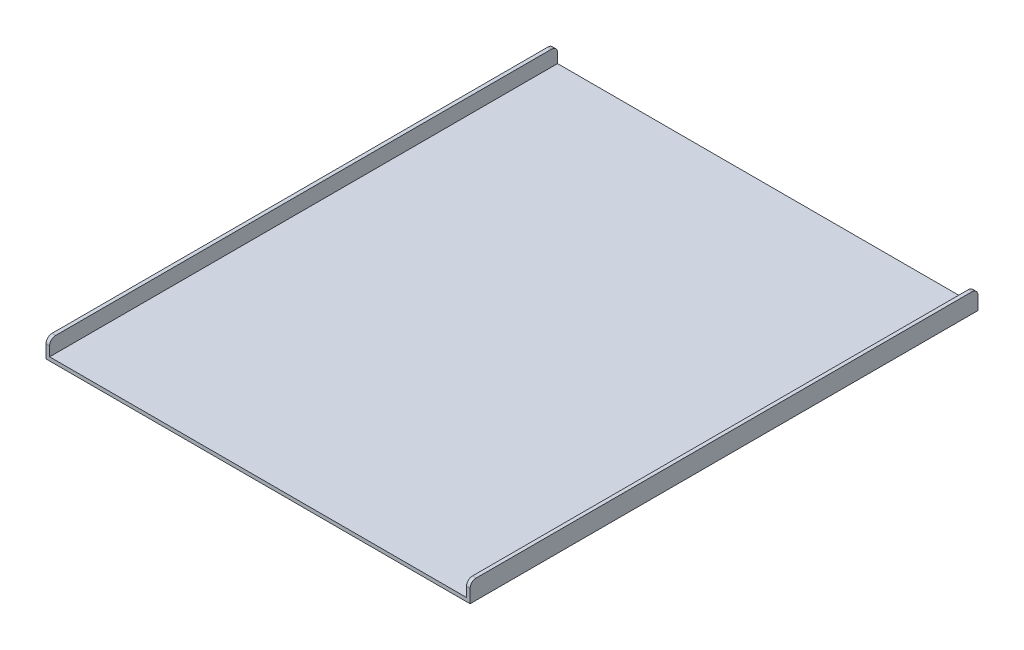
ISO-10303-21;
HEADER;
FILE_DESCRIPTION(('STEP AP214'),'2;1');
FILE_NAME('part.step','',(''),(''),'','','');
FILE_SCHEMA(('AUTOMOTIVE_DESIGN { 1 0 10303 214 1 1 1 1 }'));
ENDSEC;
DATA;
#1=APPLICATION_CONTEXT('core data for automotive mechanical design processes');
#2=APPLICATION_PROTOCOL_DEFINITION('international standard','automotive_design',2000,#1);
#3=PRODUCT_CONTEXT('',#1,'mechanical');
#4=PRODUCT('Part','Part','',(#3));
#5=PRODUCT_RELATED_PRODUCT_CATEGORY('part','',(#4));
#6=PRODUCT_DEFINITION_FORMATION('','',#4);
#7=PRODUCT_DEFINITION_CONTEXT('part definition',#1,'design');
#8=PRODUCT_DEFINITION('design','',#6,#7);
#9=PRODUCT_DEFINITION_SHAPE('','',#8);
#10=(LENGTH_UNIT() NAMED_UNIT(*) SI_UNIT(.MILLI.,.METRE.));
#11=(NAMED_UNIT(*) PLANE_ANGLE_UNIT() SI_UNIT($,.RADIAN.));
#12=(NAMED_UNIT(*) SI_UNIT($,.STERADIAN.) SOLID_ANGLE_UNIT());
#13=UNCERTAINTY_MEASURE_WITH_UNIT(LENGTH_MEASURE(1.E-05),#10,'distance_accuracy_value','');
#14=(GEOMETRIC_REPRESENTATION_CONTEXT(3) GLOBAL_UNCERTAINTY_ASSIGNED_CONTEXT((#13)) GLOBAL_UNIT_ASSIGNED_CONTEXT((#10,
#11,#12)) REPRESENTATION_CONTEXT('',''));
#15=CARTESIAN_POINT('',(0.,0.,0.));
#16=DIRECTION('',(0.,0.,1.));
#17=DIRECTION('',(1.,0.,0.));
#18=AXIS2_PLACEMENT_3D('',#15,#16,#17);
#19=CARTESIAN_POINT('',(446.551474958623,0.,421.049210887177));
#20=DIRECTION('',(-1.,0.,0.));
#21=DIRECTION('',(0.,0.,1.));
#22=AXIS2_PLACEMENT_3D('',#19,#20,#21);
#23=PLANE('',#22);
#24=DIRECTION('',(0.,1.,0.));
#25=VECTOR('',#24,1.);
#26=CARTESIAN_POINT('',(446.551474958623,0.,-421.049210887177));
#27=LINE('',#26,#25);
#28=CARTESIAN_POINT('',(446.551474958623,-6.04818389811423,-421.049210887177));
#29=VERTEX_POINT('',#28);
#30=CARTESIAN_POINT('',(446.551474958623,15.9156712813162,-421.049210887177));
#31=VERTEX_POINT('',#30);
#32=EDGE_CURVE('E157',#29,#31,#27,.T.);
#33=ORIENTED_EDGE('',*,*,#32,.T.);
#34=CARTESIAN_POINT('',(446.551474958623,15.9156712813162,-411.049210887177));
#35=DIRECTION('',(-1.,0.,0.));
#36=DIRECTION('',(0.,0.,1.));
#37=AXIS2_PLACEMENT_3D('',#34,#35,#36);
#38=CIRCLE('',#37,10.);
#39=CARTESIAN_POINT('',(446.551474958623,25.9156712813162,-411.049210887177));
#40=VERTEX_POINT('',#39);
#41=EDGE_CURVE('E206',#31,#40,#38,.F.);
#42=ORIENTED_EDGE('',*,*,#41,.T.);
#43=DIRECTION('',(0.,0.,-1.));
#44=VECTOR('',#43,1.);
#45=CARTESIAN_POINT('',(446.551474958623,25.9156712813162,421.049210887177));
#46=LINE('',#45,#44);
#47=CARTESIAN_POINT('',(446.551474958623,25.9156712813162,411.049210887177));
#48=VERTEX_POINT('',#47);
#49=EDGE_CURVE('E183',#48,#40,#46,.T.);
#50=ORIENTED_EDGE('',*,*,#49,.F.);
#51=CARTESIAN_POINT('',(446.551474958623,15.9156712813162,411.049210887177));
#52=DIRECTION('',(-1.,0.,0.));
#53=DIRECTION('',(0.,0.,1.));
#54=AXIS2_PLACEMENT_3D('',#51,#52,#53);
#55=CIRCLE('',#54,10.);
#56=CARTESIAN_POINT('',(446.551474958623,15.9156712813162,421.049210887177));
#57=VERTEX_POINT('',#56);
#58=EDGE_CURVE('E204',#48,#57,#55,.F.);
#59=ORIENTED_EDGE('',*,*,#58,.T.);
#60=DIRECTION('',(0.,1.,0.));
#61=VECTOR('',#60,1.);
#62=CARTESIAN_POINT('',(446.551474958623,0.,421.049210887177));
#63=LINE('',#62,#61);
#64=CARTESIAN_POINT('',(446.551474958623,-6.04818389811423,421.049210887177));
#65=VERTEX_POINT('',#64);
#66=EDGE_CURVE('E142',#65,#57,#63,.T.);
#67=ORIENTED_EDGE('',*,*,#66,.F.);
#68=DIRECTION('',(0.,0.,-1.));
#69=VECTOR('',#68,1.);
#70=CARTESIAN_POINT('',(446.551474958623,-6.04818389811423,421.049210887177));
#71=LINE('',#70,#69);
#72=EDGE_CURVE('E156',#65,#29,#71,.T.);
#73=ORIENTED_EDGE('',*,*,#72,.T.);
#74=EDGE_LOOP('',(#33,#42,#50,#59,#67,#73));
#75=FACE_BOUND('',#74,.T.);
#76=ADVANCED_FACE('F33',(#75),#23,.F.);
#77=CARTESIAN_POINT('',(440.503291060509,25.9156712813162,421.049210887177));
#78=DIRECTION('',(0.,1.,0.));
#79=DIRECTION('',(0.,0.,1.));
#80=AXIS2_PLACEMENT_3D('',#77,#78,#79);
#81=PLANE('',#80);
#82=ORIENTED_EDGE('',*,*,#49,.T.);
#83=DIRECTION('',(1.,0.,0.));
#84=VECTOR('',#83,1.);
#85=CARTESIAN_POINT('',(440.503291060509,25.9156712813162,-411.049210887177));
#86=LINE('',#85,#84);
#87=CARTESIAN_POINT('',(440.503291060509,25.9156712813162,-411.049210887177));
#88=VERTEX_POINT('',#87);
#89=EDGE_CURVE('E56',#40,#88,#86,.F.);
#90=ORIENTED_EDGE('',*,*,#89,.T.);
#91=DIRECTION('',(0.,0.,-1.));
#92=VECTOR('',#91,1.);
#93=CARTESIAN_POINT('',(440.503291060509,25.9156712813162,421.049210887177));
#94=LINE('',#93,#92);
#95=CARTESIAN_POINT('',(440.503291060509,25.9156712813162,411.049210887177));
#96=VERTEX_POINT('',#95);
#97=EDGE_CURVE('E135',#96,#88,#94,.T.);
#98=ORIENTED_EDGE('',*,*,#97,.F.);
#99=DIRECTION('',(1.,0.,0.));
#100=VECTOR('',#99,1.);
#101=CARTESIAN_POINT('',(446.551474958623,25.9156712813162,411.049210887177));
#102=LINE('',#101,#100);
#103=EDGE_CURVE('E208',#96,#48,#102,.T.);
#104=ORIENTED_EDGE('',*,*,#103,.T.);
#105=EDGE_LOOP('',(#82,#90,#98,#104));
#106=FACE_BOUND('',#105,.T.);
#107=ADVANCED_FACE('F244',(#106),#81,.T.);
#108=CARTESIAN_POINT('',(440.503291060509,0.,421.049210887177));
#109=DIRECTION('',(-1.,0.,0.));
#110=DIRECTION('',(0.,0.,1.));
#111=AXIS2_PLACEMENT_3D('',#108,#109,#110);
#112=PLANE('',#111);
#113=ORIENTED_EDGE('',*,*,#97,.T.);
#114=CARTESIAN_POINT('',(440.503291060509,15.9156712813162,-411.049210887177));
#115=DIRECTION('',(-1.,0.,0.));
#116=DIRECTION('',(0.,0.,1.));
#117=AXIS2_PLACEMENT_3D('',#114,#115,#116);
#118=CIRCLE('',#117,10.);
#119=CARTESIAN_POINT('',(440.503291060509,15.9156712813162,-421.049210887177));
#120=VERTEX_POINT('',#119);
#121=EDGE_CURVE('E214',#88,#120,#118,.T.);
#122=ORIENTED_EDGE('',*,*,#121,.T.);
#123=DIRECTION('',(0.,1.,0.));
#124=VECTOR('',#123,1.);
#125=CARTESIAN_POINT('',(440.503291060509,0.,-421.049210887177));
#126=LINE('',#125,#124);
#127=CARTESIAN_POINT('',(440.503291060509,0.,-421.049210887177));
#128=VERTEX_POINT('',#127);
#129=EDGE_CURVE('E130',#128,#120,#126,.T.);
#130=ORIENTED_EDGE('',*,*,#129,.F.);
#131=DIRECTION('',(0.,0.,-1.));
#132=VECTOR('',#131,1.);
#133=CARTESIAN_POINT('',(440.503291060509,0.,421.049210887177));
#134=LINE('',#133,#132);
#135=CARTESIAN_POINT('',(440.503291060509,0.,421.049210887177));
#136=VERTEX_POINT('',#135);
#137=EDGE_CURVE('E125',#136,#128,#134,.T.);
#138=ORIENTED_EDGE('',*,*,#137,.F.);
#139=DIRECTION('',(0.,1.,0.));
#140=VECTOR('',#139,1.);
#141=CARTESIAN_POINT('',(440.503291060509,0.,421.049210887177));
#142=LINE('',#141,#140);
#143=CARTESIAN_POINT('',(440.503291060509,15.9156712813162,421.049210887177));
#144=VERTEX_POINT('',#143);
#145=EDGE_CURVE('E127',#136,#144,#142,.T.);
#146=ORIENTED_EDGE('',*,*,#145,.T.);
#147=CARTESIAN_POINT('',(440.503291060509,15.9156712813162,411.049210887177));
#148=DIRECTION('',(-1.,0.,0.));
#149=DIRECTION('',(0.,0.,1.));
#150=AXIS2_PLACEMENT_3D('',#147,#148,#149);
#151=CIRCLE('',#150,10.);
#152=EDGE_CURVE('E212',#144,#96,#151,.T.);
#153=ORIENTED_EDGE('',*,*,#152,.T.);
#154=EDGE_LOOP('',(#113,#122,#130,#138,#146,#153));
#155=FACE_BOUND('',#154,.T.);
#156=ADVANCED_FACE('F126',(#155),#112,.T.);
#157=CARTESIAN_POINT('',(-250.514148936986,0.,421.049210887177));
#158=DIRECTION('',(0.,1.,0.));
#159=DIRECTION('',(0.,0.,1.));
#160=AXIS2_PLACEMENT_3D('',#157,#158,#159);
#161=PLANE('',#160);
#162=DIRECTION('',(1.,0.,0.));
#163=VECTOR('',#162,1.);
#164=CARTESIAN_POINT('',(-250.514148936986,0.,-421.049210887177));
#165=LINE('',#164,#163);
#166=CARTESIAN_POINT('',(-250.514148936986,0.,-421.049210887177));
#167=VERTEX_POINT('',#166);
#168=EDGE_CURVE('E162',#167,#128,#165,.T.);
#169=ORIENTED_EDGE('',*,*,#168,.F.);
#170=DIRECTION('',(0.,0.,-1.));
#171=VECTOR('',#170,1.);
#172=CARTESIAN_POINT('',(-250.514148936986,0.,421.049210887177));
#173=LINE('',#172,#171);
#174=CARTESIAN_POINT('',(-250.514148936986,0.,421.049210887177));
#175=VERTEX_POINT('',#174);
#176=EDGE_CURVE('E136',#175,#167,#173,.T.);
#177=ORIENTED_EDGE('',*,*,#176,.F.);
#178=DIRECTION('',(1.,0.,0.));
#179=VECTOR('',#178,1.);
#180=CARTESIAN_POINT('',(-250.514148936986,0.,421.049210887177));
#181=LINE('',#180,#179);
#182=EDGE_CURVE('E141',#175,#136,#181,.T.);
#183=ORIENTED_EDGE('',*,*,#182,.T.);
#184=ORIENTED_EDGE('',*,*,#137,.T.);
#185=EDGE_LOOP('',(#169,#177,#183,#184));
#186=FACE_BOUND('',#185,.T.);
#187=ADVANCED_FACE('F145',(#186),#161,.T.);
#188=CARTESIAN_POINT('',(-250.514148936986,25.7536347583907,421.049210887177));
#189=DIRECTION('',(1.,0.,0.));
#190=DIRECTION('',(0.,0.,-1.));
#191=AXIS2_PLACEMENT_3D('',#188,#189,#190);
#192=PLANE('',#191);
#193=DIRECTION('',(0.,-1.,0.));
#194=VECTOR('',#193,1.);
#195=CARTESIAN_POINT('',(-250.514148936986,25.7536347583907,-421.049210887177));
#196=LINE('',#195,#194);
#197=CARTESIAN_POINT('',(-250.514148936986,15.7536347583907,-421.049210887177));
#198=VERTEX_POINT('',#197);
#199=EDGE_CURVE('E164',#198,#167,#196,.T.);
#200=ORIENTED_EDGE('',*,*,#199,.F.);
#201=CARTESIAN_POINT('',(-250.514148936986,15.7536347583907,-411.049210887177));
#202=DIRECTION('',(1.,0.,0.));
#203=DIRECTION('',(0.,0.,-1.));
#204=AXIS2_PLACEMENT_3D('',#201,#202,#203);
#205=CIRCLE('',#204,10.);
#206=CARTESIAN_POINT('',(-250.514148936986,25.7536347583907,-411.049210887177));
#207=VERTEX_POINT('',#206);
#208=EDGE_CURVE('E193',#198,#207,#205,.T.);
#209=ORIENTED_EDGE('',*,*,#208,.T.);
#210=DIRECTION('',(0.,0.,-1.));
#211=VECTOR('',#210,1.);
#212=CARTESIAN_POINT('',(-250.514148936986,25.7536347583907,421.049210887177));
#213=LINE('',#212,#211);
#214=CARTESIAN_POINT('',(-250.514148936986,25.7536347583907,411.049210887177));
#215=VERTEX_POINT('',#214);
#216=EDGE_CURVE('E178',#215,#207,#213,.T.);
#217=ORIENTED_EDGE('',*,*,#216,.F.);
#218=CARTESIAN_POINT('',(-250.514148936986,15.7536347583907,411.049210887177));
#219=DIRECTION('',(1.,0.,0.));
#220=DIRECTION('',(0.,0.,-1.));
#221=AXIS2_PLACEMENT_3D('',#218,#219,#220);
#222=CIRCLE('',#221,10.);
#223=CARTESIAN_POINT('',(-250.514148936986,15.7536347583907,421.049210887177));
#224=VERTEX_POINT('',#223);
#225=EDGE_CURVE('E191',#215,#224,#222,.T.);
#226=ORIENTED_EDGE('',*,*,#225,.T.);
#227=DIRECTION('',(0.,-1.,0.));
#228=VECTOR('',#227,1.);
#229=CARTESIAN_POINT('',(-250.514148936986,25.7536347583907,421.049210887177));
#230=LINE('',#229,#228);
#231=EDGE_CURVE('E147',#224,#175,#230,.T.);
#232=ORIENTED_EDGE('',*,*,#231,.T.);
#233=ORIENTED_EDGE('',*,*,#176,.T.);
#234=EDGE_LOOP('',(#200,#209,#217,#226,#232,#233));
#235=FACE_BOUND('',#234,.T.);
#236=ADVANCED_FACE('F307',(#235),#192,.T.);
#237=CARTESIAN_POINT('',(-256.5623328351,25.7536347583907,421.049210887177));
#238=DIRECTION('',(0.,1.,0.));
#239=DIRECTION('',(0.,0.,1.));
#240=AXIS2_PLACEMENT_3D('',#237,#238,#239);
#241=PLANE('',#240);
#242=ORIENTED_EDGE('',*,*,#216,.T.);
#243=DIRECTION('',(1.,0.,0.));
#244=VECTOR('',#243,1.);
#245=CARTESIAN_POINT('',(-256.5623328351,25.7536347583907,-411.049210887177));
#246=LINE('',#245,#244);
#247=CARTESIAN_POINT('',(-256.5623328351,25.7536347583907,-411.049210887177));
#248=VERTEX_POINT('',#247);
#249=EDGE_CURVE('E198',#207,#248,#246,.F.);
#250=ORIENTED_EDGE('',*,*,#249,.T.);
#251=DIRECTION('',(0.,0.,-1.));
#252=VECTOR('',#251,1.);
#253=CARTESIAN_POINT('',(-256.5623328351,25.7536347583907,421.049210887177));
#254=LINE('',#253,#252);
#255=CARTESIAN_POINT('',(-256.5623328351,25.7536347583907,411.049210887177));
#256=VERTEX_POINT('',#255);
#257=EDGE_CURVE('E175',#256,#248,#254,.T.);
#258=ORIENTED_EDGE('',*,*,#257,.F.);
#259=DIRECTION('',(1.,0.,0.));
#260=VECTOR('',#259,1.);
#261=CARTESIAN_POINT('',(-250.514148936986,25.7536347583907,411.049210887177));
#262=LINE('',#261,#260);
#263=EDGE_CURVE('E195',#256,#215,#262,.T.);
#264=ORIENTED_EDGE('',*,*,#263,.T.);
#265=EDGE_LOOP('',(#242,#250,#258,#264));
#266=FACE_BOUND('',#265,.T.);
#267=ADVANCED_FACE('F301',(#266),#241,.T.);
#268=CARTESIAN_POINT('',(-256.5623328351,25.7536347583907,421.049210887177));
#269=DIRECTION('',(1.,0.,0.));
#270=DIRECTION('',(0.,0.,-1.));
#271=AXIS2_PLACEMENT_3D('',#268,#269,#270);
#272=PLANE('',#271);
#273=ORIENTED_EDGE('',*,*,#257,.T.);
#274=CARTESIAN_POINT('',(-256.5623328351,15.7536347583907,-411.049210887177));
#275=DIRECTION('',(1.,0.,0.));
#276=DIRECTION('',(0.,0.,-1.));
#277=AXIS2_PLACEMENT_3D('',#274,#275,#276);
#278=CIRCLE('',#277,10.);
#279=CARTESIAN_POINT('',(-256.5623328351,15.7536347583907,-421.049210887177));
#280=VERTEX_POINT('',#279);
#281=EDGE_CURVE('E202',#248,#280,#278,.F.);
#282=ORIENTED_EDGE('',*,*,#281,.T.);
#283=DIRECTION('',(0.,1.,0.));
#284=VECTOR('',#283,1.);
#285=CARTESIAN_POINT('',(-256.5623328351,25.7536347583907,-421.049210887177));
#286=LINE('',#285,#284);
#287=CARTESIAN_POINT('',(-256.5623328351,-6.04818389811423,-421.049210887177));
#288=VERTEX_POINT('',#287);
#289=EDGE_CURVE('E166',#280,#288,#286,.F.);
#290=ORIENTED_EDGE('',*,*,#289,.T.);
#291=DIRECTION('',(0.,0.,-1.));
#292=VECTOR('',#291,1.);
#293=CARTESIAN_POINT('',(-256.5623328351,-6.04818389811423,421.049210887177));
#294=LINE('',#293,#292);
#295=CARTESIAN_POINT('',(-256.5623328351,-6.04818389811423,421.049210887177));
#296=VERTEX_POINT('',#295);
#297=EDGE_CURVE('E172',#296,#288,#294,.T.);
#298=ORIENTED_EDGE('',*,*,#297,.F.);
#299=DIRECTION('',(0.,1.,0.));
#300=VECTOR('',#299,1.);
#301=CARTESIAN_POINT('',(-256.5623328351,25.7536347583907,421.049210887177));
#302=LINE('',#301,#300);
#303=CARTESIAN_POINT('',(-256.5623328351,15.7536347583907,421.049210887177));
#304=VERTEX_POINT('',#303);
#305=EDGE_CURVE('E149',#304,#296,#302,.F.);
#306=ORIENTED_EDGE('',*,*,#305,.F.);
#307=CARTESIAN_POINT('',(-256.5623328351,15.7536347583907,411.049210887177));
#308=DIRECTION('',(1.,0.,0.));
#309=DIRECTION('',(0.,0.,-1.));
#310=AXIS2_PLACEMENT_3D('',#307,#308,#309);
#311=CIRCLE('',#310,10.);
#312=EDGE_CURVE('E200',#304,#256,#311,.F.);
#313=ORIENTED_EDGE('',*,*,#312,.T.);
#314=EDGE_LOOP('',(#273,#282,#290,#298,#306,#313));
#315=FACE_BOUND('',#314,.T.);
#316=ADVANCED_FACE('F226',(#315),#272,.F.);
#317=CARTESIAN_POINT('',(-250.514148936986,-6.04818389811423,421.049210887177));
#318=DIRECTION('',(0.,1.,0.));
#319=DIRECTION('',(0.,0.,1.));
#320=AXIS2_PLACEMENT_3D('',#317,#318,#319);
#321=PLANE('',#320);
#322=CARTESIAN_POINT('',(-175.410326922227,-6.04818389811423,359.721177401353));
#323=DIRECTION('',(0.,1.,0.));
#324=DIRECTION('',(0.,0.,1.));
#325=AXIS2_PLACEMENT_3D('',#322,#323,#324);
#326=CIRCLE('',#325,19.05);
#327=CARTESIAN_POINT('',(-175.410326922227,-6.04818389811423,378.771177401353));
#328=VERTEX_POINT('',#327);
#329=EDGE_CURVE('E11',#328,#328,#326,.F.);
#330=ORIENTED_EDGE('',*,*,#329,.F.);
#331=EDGE_LOOP('',(#330));
#332=FACE_BOUND('',#331,.T.);
#333=CARTESIAN_POINT('',(360.164689426128,-6.04818389811423,-358.012657815124));
#334=DIRECTION('',(0.,1.,0.));
#335=DIRECTION('',(0.,0.,1.));
#336=AXIS2_PLACEMENT_3D('',#333,#334,#335);
#337=CIRCLE('',#336,19.05);
#338=CARTESIAN_POINT('',(360.164689426128,-6.04818389811423,-338.962657815124));
#339=VERTEX_POINT('',#338);
#340=EDGE_CURVE('E41',#339,#339,#337,.F.);
#341=ORIENTED_EDGE('',*,*,#340,.F.);
#342=EDGE_LOOP('',(#341));
#343=FACE_BOUND('',#342,.T.);
#344=DIRECTION('',(1.,0.,0.));
#345=VECTOR('',#344,1.);
#346=CARTESIAN_POINT('',(-250.514148936986,-6.04818389811423,-421.049210887177));
#347=LINE('',#346,#345);
#348=EDGE_CURVE('E168',#288,#29,#347,.T.);
#349=ORIENTED_EDGE('',*,*,#348,.T.);
#350=ORIENTED_EDGE('',*,*,#72,.F.);
#351=DIRECTION('',(1.,0.,0.));
#352=VECTOR('',#351,1.);
#353=CARTESIAN_POINT('',(-250.514148936986,-6.04818389811423,421.049210887177));
#354=LINE('',#353,#352);
#355=EDGE_CURVE('E154',#296,#65,#354,.T.);
#356=ORIENTED_EDGE('',*,*,#355,.F.);
#357=ORIENTED_EDGE('',*,*,#297,.T.);
#358=EDGE_LOOP('',(#349,#350,#356,#357));
#359=FACE_BOUND('',#358,.T.);
#360=ADVANCED_FACE('F223',(#332,#343,#359),#321,.F.);
#361=CARTESIAN_POINT('',(0.,0.,421.049210887177));
#362=DIRECTION('',(0.,0.,-1.));
#363=DIRECTION('',(-1.,0.,0.));
#364=AXIS2_PLACEMENT_3D('',#361,#362,#363);
#365=PLANE('',#364);
#366=ORIENTED_EDGE('',*,*,#66,.T.);
#367=DIRECTION('',(1.,0.,0.));
#368=VECTOR('',#367,1.);
#369=CARTESIAN_POINT('',(440.503291060509,15.9156712813162,421.049210887177));
#370=LINE('',#369,#368);
#371=EDGE_CURVE('E48',#57,#144,#370,.F.);
#372=ORIENTED_EDGE('',*,*,#371,.T.);
#373=ORIENTED_EDGE('',*,*,#145,.F.);
#374=ORIENTED_EDGE('',*,*,#182,.F.);
#375=ORIENTED_EDGE('',*,*,#231,.F.);
#376=DIRECTION('',(1.,0.,0.));
#377=VECTOR('',#376,1.);
#378=CARTESIAN_POINT('',(-256.5623328351,15.7536347583907,421.049210887177));
#379=LINE('',#378,#377);
#380=EDGE_CURVE('E216',#224,#304,#379,.F.);
#381=ORIENTED_EDGE('',*,*,#380,.T.);
#382=ORIENTED_EDGE('',*,*,#305,.T.);
#383=ORIENTED_EDGE('',*,*,#355,.T.);
#384=EDGE_LOOP('',(#366,#372,#373,#374,#375,#381,#382,#383));
#385=FACE_BOUND('',#384,.T.);
#386=ADVANCED_FACE('F139',(#385),#365,.F.);
#387=CARTESIAN_POINT('',(0.,0.,-421.049210887177));
#388=DIRECTION('',(0.,0.,-1.));
#389=DIRECTION('',(-1.,0.,0.));
#390=AXIS2_PLACEMENT_3D('',#387,#388,#389);
#391=PLANE('',#390);
#392=ORIENTED_EDGE('',*,*,#289,.F.);
#393=DIRECTION('',(1.,0.,0.));
#394=VECTOR('',#393,1.);
#395=CARTESIAN_POINT('',(0.,15.7536347583907,-421.049210887177));
#396=LINE('',#395,#394);
#397=EDGE_CURVE('E188',#280,#198,#396,.T.);
#398=ORIENTED_EDGE('',*,*,#397,.T.);
#399=ORIENTED_EDGE('',*,*,#199,.T.);
#400=ORIENTED_EDGE('',*,*,#168,.T.);
#401=ORIENTED_EDGE('',*,*,#129,.T.);
#402=DIRECTION('',(1.,0.,0.));
#403=VECTOR('',#402,1.);
#404=CARTESIAN_POINT('',(0.,15.9156712813162,-421.049210887177));
#405=LINE('',#404,#403);
#406=EDGE_CURVE('E185',#120,#31,#405,.T.);
#407=ORIENTED_EDGE('',*,*,#406,.T.);
#408=ORIENTED_EDGE('',*,*,#32,.F.);
#409=ORIENTED_EDGE('',*,*,#348,.F.);
#410=EDGE_LOOP('',(#392,#398,#399,#400,#401,#407,#408,#409));
#411=FACE_BOUND('',#410,.T.);
#412=ADVANCED_FACE('F238',(#411),#391,.T.);
#413=CARTESIAN_POINT('',(0.,15.7536347583907,-411.049210887177));
#414=DIRECTION('',(1.,0.,0.));
#415=DIRECTION('',(0.,0.,-1.));
#416=AXIS2_PLACEMENT_3D('',#413,#414,#415);
#417=CYLINDRICAL_SURFACE('',#416,10.);
#418=ORIENTED_EDGE('',*,*,#281,.F.);
#419=ORIENTED_EDGE('',*,*,#249,.F.);
#420=ORIENTED_EDGE('',*,*,#208,.F.);
#421=ORIENTED_EDGE('',*,*,#397,.F.);
#422=EDGE_LOOP('',(#418,#419,#420,#421));
#423=FACE_BOUND('',#422,.T.);
#424=ADVANCED_FACE('F278',(#423),#417,.T.);
#425=CARTESIAN_POINT('',(0.,15.9156712813162,-411.049210887177));
#426=DIRECTION('',(1.,0.,0.));
#427=DIRECTION('',(0.,0.,-1.));
#428=AXIS2_PLACEMENT_3D('',#425,#426,#427);
#429=CYLINDRICAL_SURFACE('',#428,10.);
#430=ORIENTED_EDGE('',*,*,#121,.F.);
#431=ORIENTED_EDGE('',*,*,#89,.F.);
#432=ORIENTED_EDGE('',*,*,#41,.F.);
#433=ORIENTED_EDGE('',*,*,#406,.F.);
#434=EDGE_LOOP('',(#430,#431,#432,#433));
#435=FACE_BOUND('',#434,.T.);
#436=ADVANCED_FACE('F242',(#435),#429,.T.);
#437=CARTESIAN_POINT('',(440.503291060509,15.9156712813162,411.049210887177));
#438=DIRECTION('',(-1.,0.,0.));
#439=DIRECTION('',(0.,0.,1.));
#440=AXIS2_PLACEMENT_3D('',#437,#438,#439);
#441=CYLINDRICAL_SURFACE('',#440,10.);
#442=ORIENTED_EDGE('',*,*,#152,.F.);
#443=ORIENTED_EDGE('',*,*,#371,.F.);
#444=ORIENTED_EDGE('',*,*,#58,.F.);
#445=ORIENTED_EDGE('',*,*,#103,.F.);
#446=EDGE_LOOP('',(#442,#443,#444,#445));
#447=FACE_BOUND('',#446,.T.);
#448=ADVANCED_FACE('F247',(#447),#441,.T.);
#449=CARTESIAN_POINT('',(-256.5623328351,15.7536347583907,411.049210887177));
#450=DIRECTION('',(-1.,0.,0.));
#451=DIRECTION('',(0.,0.,1.));
#452=AXIS2_PLACEMENT_3D('',#449,#450,#451);
#453=CYLINDRICAL_SURFACE('',#452,10.);
#454=ORIENTED_EDGE('',*,*,#312,.F.);
#455=ORIENTED_EDGE('',*,*,#380,.F.);
#456=ORIENTED_EDGE('',*,*,#225,.F.);
#457=ORIENTED_EDGE('',*,*,#263,.F.);
#458=EDGE_LOOP('',(#454,#455,#456,#457));
#459=FACE_BOUND('',#458,.T.);
#460=ADVANCED_FACE('F35',(#459),#453,.T.);
#461=CARTESIAN_POINT('',(360.164689426128,-29.2979254583527,-358.012657815124));
#462=DIRECTION('',(0.,1.,0.));
#463=DIRECTION('',(0.,0.,1.));
#464=AXIS2_PLACEMENT_3D('',#461,#462,#463);
#465=CYLINDRICAL_SURFACE('',#464,19.05);
#466=CARTESIAN_POINT('',(360.164689426128,-29.2979254583527,-358.012657815124));
#467=DIRECTION('',(0.,-1.,0.));
#468=DIRECTION('',(0.,0.,-1.));
#469=AXIS2_PLACEMENT_3D('',#466,#467,#468);
#470=CIRCLE('',#469,19.05);
#471=CARTESIAN_POINT('',(360.164689426128,-29.2979254583527,-377.062657815124));
#472=VERTEX_POINT('',#471);
#473=EDGE_CURVE('E160',#472,#472,#470,.T.);
#474=ORIENTED_EDGE('',*,*,#473,.F.);
#475=EDGE_LOOP('',(#474));
#476=FACE_BOUND('',#475,.T.);
#477=ORIENTED_EDGE('',*,*,#340,.T.);
#478=EDGE_LOOP('',(#477));
#479=FACE_BOUND('',#478,.T.);
#480=ADVANCED_FACE('F221',(#476,#479),#465,.T.);
#481=CARTESIAN_POINT('',(360.164689426128,-29.2979254583527,-358.012657815124));
#482=DIRECTION('',(0.,-1.,0.));
#483=DIRECTION('',(0.,0.,-1.));
#484=AXIS2_PLACEMENT_3D('',#481,#482,#483);
#485=PLANE('',#484);
#486=ORIENTED_EDGE('',*,*,#473,.T.);
#487=EDGE_LOOP('',(#486));
#488=FACE_BOUND('',#487,.T.);
#489=ADVANCED_FACE('F260',(#488),#485,.T.);
#490=CARTESIAN_POINT('',(-175.410326922227,-32.0481838981142,359.721177401353));
#491=DIRECTION('',(0.,1.,0.));
#492=DIRECTION('',(0.,0.,1.));
#493=AXIS2_PLACEMENT_3D('',#490,#491,#492);
#494=CYLINDRICAL_SURFACE('',#493,19.05);
#495=CARTESIAN_POINT('',(-175.410326922227,-32.0481838981142,359.721177401353));
#496=DIRECTION('',(0.,-1.,0.));
#497=DIRECTION('',(0.,0.,-1.));
#498=AXIS2_PLACEMENT_3D('',#495,#496,#497);
#499=CIRCLE('',#498,19.05);
#500=CARTESIAN_POINT('',(-175.410326922227,-32.0481838981142,340.671177401353));
#501=VERTEX_POINT('',#500);
#502=EDGE_CURVE('E251',#501,#501,#499,.T.);
#503=ORIENTED_EDGE('',*,*,#502,.F.);
#504=EDGE_LOOP('',(#503));
#505=FACE_BOUND('',#504,.T.);
#506=ORIENTED_EDGE('',*,*,#329,.T.);
#507=EDGE_LOOP('',(#506));
#508=FACE_BOUND('',#507,.T.);
#509=ADVANCED_FACE('F257',(#505,#508),#494,.T.);
#510=CARTESIAN_POINT('',(-175.410326922227,-32.0481838981142,359.721177401353));
#511=DIRECTION('',(0.,-1.,0.));
#512=DIRECTION('',(0.,0.,-1.));
#513=AXIS2_PLACEMENT_3D('',#510,#511,#512);
#514=PLANE('',#513);
#515=ORIENTED_EDGE('',*,*,#502,.T.);
#516=EDGE_LOOP('',(#515));
#517=FACE_BOUND('',#516,.T.);
#518=ADVANCED_FACE('F255',(#517),#514,.T.);
#519=CLOSED_SHELL('',(#76,#107,#156,#187,#236,#267,#316,#360,#386,#412,#424,#436,#448,#460,#480,
#489,#509,#518));
#520=MANIFOLD_SOLID_BREP('B2',#519);
#521=ADVANCED_BREP_SHAPE_REPRESENTATION('',(#18,#520),#14);
#522=SHAPE_DEFINITION_REPRESENTATION(#9,#521);
ENDSEC;
END-ISO-10303-21;
